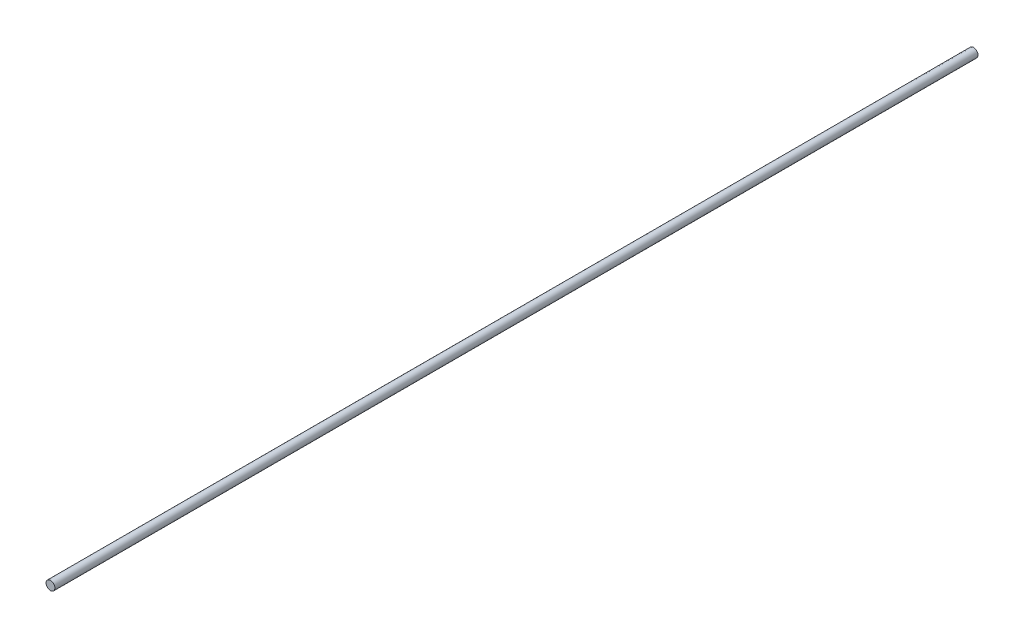
ISO-10303-21;
HEADER;
FILE_DESCRIPTION(('STEP AP214'),'2;1');
FILE_NAME('part.step','',(''),(''),'','','');
FILE_SCHEMA(('AUTOMOTIVE_DESIGN { 1 0 10303 214 1 1 1 1 }'));
ENDSEC;
DATA;
#1=APPLICATION_CONTEXT('core data for automotive mechanical design processes');
#2=APPLICATION_PROTOCOL_DEFINITION('international standard','automotive_design',2000,#1);
#3=PRODUCT_CONTEXT('',#1,'mechanical');
#4=PRODUCT('Part','Part','',(#3));
#5=PRODUCT_RELATED_PRODUCT_CATEGORY('part','',(#4));
#6=PRODUCT_DEFINITION_FORMATION('','',#4);
#7=PRODUCT_DEFINITION_CONTEXT('part definition',#1,'design');
#8=PRODUCT_DEFINITION('design','',#6,#7);
#9=PRODUCT_DEFINITION_SHAPE('','',#8);
#10=(LENGTH_UNIT() NAMED_UNIT(*) SI_UNIT(.MILLI.,.METRE.));
#11=(NAMED_UNIT(*) PLANE_ANGLE_UNIT() SI_UNIT($,.RADIAN.));
#12=(NAMED_UNIT(*) SI_UNIT($,.STERADIAN.) SOLID_ANGLE_UNIT());
#13=UNCERTAINTY_MEASURE_WITH_UNIT(LENGTH_MEASURE(1.E-05),#10,'distance_accuracy_value','');
#14=(GEOMETRIC_REPRESENTATION_CONTEXT(3) GLOBAL_UNCERTAINTY_ASSIGNED_CONTEXT((#13)) GLOBAL_UNIT_ASSIGNED_CONTEXT((#10,
#11,#12)) REPRESENTATION_CONTEXT('',''));
#15=CARTESIAN_POINT('',(0.,0.,0.));
#16=DIRECTION('',(0.,0.,1.));
#17=DIRECTION('',(1.,0.,0.));
#18=AXIS2_PLACEMENT_3D('',#15,#16,#17);
#19=CARTESIAN_POINT('',(86.9962311728574,-86.9962311728574,689.34072331388));
#20=DIRECTION('',(0.,0.,-1.));
#21=DIRECTION('',(-1.,0.,0.));
#22=AXIS2_PLACEMENT_3D('',#19,#20,#21);
#23=CYLINDRICAL_SURFACE('',#22,3.50000000000005);
#24=CARTESIAN_POINT('',(86.9962311728574,-86.9962311728574,654.041228377268));
#25=DIRECTION('',(0.,0.,-1.));
#26=DIRECTION('',(-1.,0.,0.));
#27=AXIS2_PLACEMENT_3D('',#24,#25,#26);
#28=CIRCLE('',#27,3.50000000000005);
#29=CARTESIAN_POINT('',(83.4962311728574,-86.9962311728574,654.041228377268));
#30=VERTEX_POINT('',#29);
#31=EDGE_CURVE('E10',#30,#30,#28,.T.);
#32=ORIENTED_EDGE('',*,*,#31,.T.);
#33=EDGE_LOOP('',(#32));
#34=FACE_BOUND('',#33,.T.);
#35=CARTESIAN_POINT('',(86.9962311728574,-86.9962311728574,-72.0939716227321));
#36=DIRECTION('',(0.,0.,-1.));
#37=DIRECTION('',(-1.,0.,0.));
#38=AXIS2_PLACEMENT_3D('',#35,#36,#37);
#39=CIRCLE('',#38,3.50000000000005);
#40=CARTESIAN_POINT('',(83.4962311728574,-86.9962311728574,-72.0939716227321));
#41=VERTEX_POINT('',#40);
#42=EDGE_CURVE('E37',#41,#41,#39,.F.);
#43=ORIENTED_EDGE('',*,*,#42,.T.);
#44=EDGE_LOOP('',(#43));
#45=FACE_BOUND('',#44,.T.);
#46=ADVANCED_FACE('F31',(#34,#45),#23,.T.);
#47=CARTESIAN_POINT('',(235.962846170974,-33.4332928730591,654.041228377268));
#48=DIRECTION('',(0.,0.,-1.));
#49=DIRECTION('',(-0.823528490707273,0.567274911302625,0.));
#50=AXIS2_PLACEMENT_3D('',#47,#48,#49);
#51=PLANE('',#50);
#52=ORIENTED_EDGE('',*,*,#31,.F.);
#53=EDGE_LOOP('',(#52));
#54=FACE_BOUND('',#53,.T.);
#55=ADVANCED_FACE('F46',(#54),#51,.F.);
#56=CARTESIAN_POINT('',(64.7031355400987,33.9984231043922,-72.0939716227321));
#57=DIRECTION('',(0.,0.,-1.));
#58=DIRECTION('',(-0.823528490707281,0.567274911302613,0.));
#59=AXIS2_PLACEMENT_3D('',#56,#57,#58);
#60=PLANE('',#59);
#61=ORIENTED_EDGE('',*,*,#42,.F.);
#62=EDGE_LOOP('',(#61));
#63=FACE_BOUND('',#62,.T.);
#64=ADVANCED_FACE('F44',(#63),#60,.T.);
#65=CLOSED_SHELL('',(#46,#55,#64));
#66=MANIFOLD_SOLID_BREP('B2',#65);
#67=ADVANCED_BREP_SHAPE_REPRESENTATION('',(#18,#66),#14);
#68=SHAPE_DEFINITION_REPRESENTATION(#9,#67);
ENDSEC;
END-ISO-10303-21;
